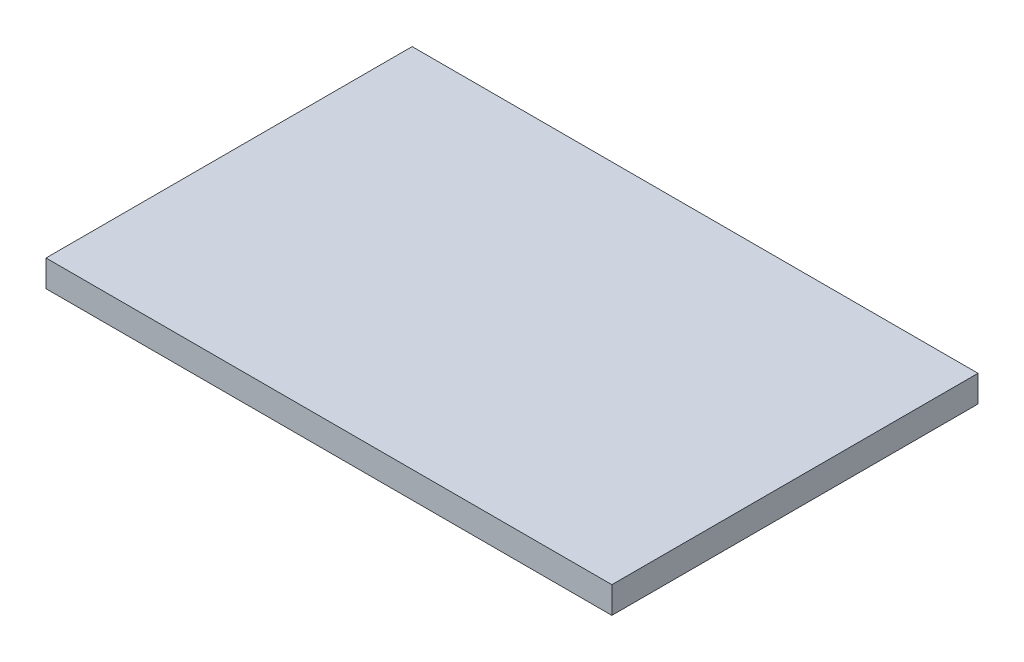
ISO-10303-21;
HEADER;
FILE_DESCRIPTION(('STEP AP214'),'2;1');
FILE_NAME('part.step','',(''),(''),'','','');
FILE_SCHEMA(('AUTOMOTIVE_DESIGN { 1 0 10303 214 1 1 1 1 }'));
ENDSEC;
DATA;
#1=APPLICATION_CONTEXT('core data for automotive mechanical design processes');
#2=APPLICATION_PROTOCOL_DEFINITION('international standard','automotive_design',2000,#1);
#3=PRODUCT_CONTEXT('',#1,'mechanical');
#4=PRODUCT('Part','Part','',(#3));
#5=PRODUCT_RELATED_PRODUCT_CATEGORY('part','',(#4));
#6=PRODUCT_DEFINITION_FORMATION('','',#4);
#7=PRODUCT_DEFINITION_CONTEXT('part definition',#1,'design');
#8=PRODUCT_DEFINITION('design','',#6,#7);
#9=PRODUCT_DEFINITION_SHAPE('','',#8);
#10=(LENGTH_UNIT() NAMED_UNIT(*) SI_UNIT(.MILLI.,.METRE.));
#11=(NAMED_UNIT(*) PLANE_ANGLE_UNIT() SI_UNIT($,.RADIAN.));
#12=(NAMED_UNIT(*) SI_UNIT($,.STERADIAN.) SOLID_ANGLE_UNIT());
#13=UNCERTAINTY_MEASURE_WITH_UNIT(LENGTH_MEASURE(1.E-05),#10,'distance_accuracy_value','');
#14=(GEOMETRIC_REPRESENTATION_CONTEXT(3) GLOBAL_UNCERTAINTY_ASSIGNED_CONTEXT((#13)) GLOBAL_UNIT_ASSIGNED_CONTEXT((#10,
#11,#12)) REPRESENTATION_CONTEXT('',''));
#15=CARTESIAN_POINT('',(0.,0.,0.));
#16=DIRECTION('',(0.,0.,1.));
#17=DIRECTION('',(1.,0.,0.));
#18=AXIS2_PLACEMENT_3D('',#15,#16,#17);
#19=CARTESIAN_POINT('',(0.,4.,0.));
#20=DIRECTION('',(1.,0.,0.));
#21=DIRECTION('',(0.,0.,-1.));
#22=AXIS2_PLACEMENT_3D('',#19,#20,#21);
#23=PLANE('',#22);
#24=DIRECTION('',(0.,0.,1.));
#25=VECTOR('',#24,1.);
#26=CARTESIAN_POINT('',(0.,0.,0.));
#27=LINE('',#26,#25);
#28=CARTESIAN_POINT('',(0.,0.,0.));
#29=VERTEX_POINT('',#28);
#30=CARTESIAN_POINT('',(0.,0.,55.));
#31=VERTEX_POINT('',#30);
#32=EDGE_CURVE('E111',#29,#31,#27,.T.);
#33=ORIENTED_EDGE('',*,*,#32,.T.);
#34=DIRECTION('',(0.,-1.,0.));
#35=VECTOR('',#34,1.);
#36=CARTESIAN_POINT('',(0.,4.,55.));
#37=LINE('',#36,#35);
#38=CARTESIAN_POINT('',(0.,4.,55.));
#39=VERTEX_POINT('',#38);
#40=EDGE_CURVE('E11',#39,#31,#37,.T.);
#41=ORIENTED_EDGE('',*,*,#40,.F.);
#42=DIRECTION('',(0.,0.,1.));
#43=VECTOR('',#42,1.);
#44=CARTESIAN_POINT('',(0.,4.,0.));
#45=LINE('',#44,#43);
#46=CARTESIAN_POINT('',(0.,4.,0.));
#47=VERTEX_POINT('',#46);
#48=EDGE_CURVE('E95',#47,#39,#45,.T.);
#49=ORIENTED_EDGE('',*,*,#48,.F.);
#50=DIRECTION('',(0.,-1.,0.));
#51=VECTOR('',#50,1.);
#52=CARTESIAN_POINT('',(0.,4.,0.));
#53=LINE('',#52,#51);
#54=EDGE_CURVE('E107',#47,#29,#53,.T.);
#55=ORIENTED_EDGE('',*,*,#54,.T.);
#56=EDGE_LOOP('',(#33,#41,#49,#55));
#57=FACE_BOUND('',#56,.T.);
#58=ADVANCED_FACE('F43',(#57),#23,.F.);
#59=CARTESIAN_POINT('',(0.,4.,55.));
#60=DIRECTION('',(0.,0.,-1.));
#61=DIRECTION('',(-1.,0.,0.));
#62=AXIS2_PLACEMENT_3D('',#59,#60,#61);
#63=PLANE('',#62);
#64=DIRECTION('',(1.,0.,0.));
#65=VECTOR('',#64,1.);
#66=CARTESIAN_POINT('',(0.,0.,55.));
#67=LINE('',#66,#65);
#68=CARTESIAN_POINT('',(85.,0.,55.));
#69=VERTEX_POINT('',#68);
#70=EDGE_CURVE('E100',#31,#69,#67,.T.);
#71=ORIENTED_EDGE('',*,*,#70,.T.);
#72=DIRECTION('',(0.,-1.,0.));
#73=VECTOR('',#72,1.);
#74=CARTESIAN_POINT('',(85.,4.,55.));
#75=LINE('',#74,#73);
#76=CARTESIAN_POINT('',(85.,4.,55.));
#77=VERTEX_POINT('',#76);
#78=EDGE_CURVE('E52',#77,#69,#75,.T.);
#79=ORIENTED_EDGE('',*,*,#78,.F.);
#80=DIRECTION('',(1.,0.,0.));
#81=VECTOR('',#80,1.);
#82=CARTESIAN_POINT('',(0.,4.,55.));
#83=LINE('',#82,#81);
#84=EDGE_CURVE('E90',#39,#77,#83,.T.);
#85=ORIENTED_EDGE('',*,*,#84,.F.);
#86=ORIENTED_EDGE('',*,*,#40,.T.);
#87=EDGE_LOOP('',(#71,#79,#85,#86));
#88=FACE_BOUND('',#87,.T.);
#89=ADVANCED_FACE('F99',(#88),#63,.F.);
#90=CARTESIAN_POINT('',(85.,4.,0.));
#91=DIRECTION('',(-1.,0.,0.));
#92=DIRECTION('',(0.,0.,1.));
#93=AXIS2_PLACEMENT_3D('',#90,#91,#92);
#94=PLANE('',#93);
#95=DIRECTION('',(0.,0.,-1.));
#96=VECTOR('',#95,1.);
#97=CARTESIAN_POINT('',(85.,0.,0.));
#98=LINE('',#97,#96);
#99=CARTESIAN_POINT('',(85.,0.,0.));
#100=VERTEX_POINT('',#99);
#101=EDGE_CURVE('E77',#69,#100,#98,.T.);
#102=ORIENTED_EDGE('',*,*,#101,.T.);
#103=DIRECTION('',(0.,-1.,0.));
#104=VECTOR('',#103,1.);
#105=CARTESIAN_POINT('',(85.,4.,0.));
#106=LINE('',#105,#104);
#107=CARTESIAN_POINT('',(85.,4.,0.));
#108=VERTEX_POINT('',#107);
#109=EDGE_CURVE('E102',#108,#100,#106,.T.);
#110=ORIENTED_EDGE('',*,*,#109,.F.);
#111=DIRECTION('',(0.,0.,-1.));
#112=VECTOR('',#111,1.);
#113=CARTESIAN_POINT('',(85.,4.,0.));
#114=LINE('',#113,#112);
#115=EDGE_CURVE('E93',#77,#108,#114,.T.);
#116=ORIENTED_EDGE('',*,*,#115,.F.);
#117=ORIENTED_EDGE('',*,*,#78,.T.);
#118=EDGE_LOOP('',(#102,#110,#116,#117));
#119=FACE_BOUND('',#118,.T.);
#120=ADVANCED_FACE('F103',(#119),#94,.F.);
#121=CARTESIAN_POINT('',(0.,4.,0.));
#122=DIRECTION('',(0.,0.,1.));
#123=DIRECTION('',(1.,0.,0.));
#124=AXIS2_PLACEMENT_3D('',#121,#122,#123);
#125=PLANE('',#124);
#126=DIRECTION('',(-1.,0.,0.));
#127=VECTOR('',#126,1.);
#128=CARTESIAN_POINT('',(0.,0.,0.));
#129=LINE('',#128,#127);
#130=EDGE_CURVE('E83',#100,#29,#129,.T.);
#131=ORIENTED_EDGE('',*,*,#130,.T.);
#132=ORIENTED_EDGE('',*,*,#54,.F.);
#133=DIRECTION('',(-1.,0.,0.));
#134=VECTOR('',#133,1.);
#135=CARTESIAN_POINT('',(0.,4.,0.));
#136=LINE('',#135,#134);
#137=EDGE_CURVE('E60',#108,#47,#136,.T.);
#138=ORIENTED_EDGE('',*,*,#137,.F.);
#139=ORIENTED_EDGE('',*,*,#109,.T.);
#140=EDGE_LOOP('',(#131,#132,#138,#139));
#141=FACE_BOUND('',#140,.T.);
#142=ADVANCED_FACE('F124',(#141),#125,.F.);
#143=CARTESIAN_POINT('',(0.,4.,0.));
#144=DIRECTION('',(0.,1.,0.));
#145=DIRECTION('',(0.,0.,1.));
#146=AXIS2_PLACEMENT_3D('',#143,#144,#145);
#147=PLANE('',#146);
#148=ORIENTED_EDGE('',*,*,#48,.T.);
#149=ORIENTED_EDGE('',*,*,#84,.T.);
#150=ORIENTED_EDGE('',*,*,#115,.T.);
#151=ORIENTED_EDGE('',*,*,#137,.T.);
#152=EDGE_LOOP('',(#148,#149,#150,#151));
#153=FACE_BOUND('',#152,.T.);
#154=ADVANCED_FACE('F91',(#153),#147,.T.);
#155=CARTESIAN_POINT('',(0.,0.,0.));
#156=DIRECTION('',(0.,1.,0.));
#157=DIRECTION('',(0.,0.,1.));
#158=AXIS2_PLACEMENT_3D('',#155,#156,#157);
#159=PLANE('',#158);
#160=ORIENTED_EDGE('',*,*,#32,.F.);
#161=ORIENTED_EDGE('',*,*,#130,.F.);
#162=ORIENTED_EDGE('',*,*,#101,.F.);
#163=ORIENTED_EDGE('',*,*,#70,.F.);
#164=EDGE_LOOP('',(#160,#161,#162,#163));
#165=FACE_BOUND('',#164,.T.);
#166=ADVANCED_FACE('F127',(#165),#159,.F.);
#167=CLOSED_SHELL('',(#58,#89,#120,#142,#154,#166));
#168=MANIFOLD_SOLID_BREP('B2',#167);
#169=ADVANCED_BREP_SHAPE_REPRESENTATION('',(#18,#168),#14);
#170=SHAPE_DEFINITION_REPRESENTATION(#9,#169);
ENDSEC;
END-ISO-10303-21;
